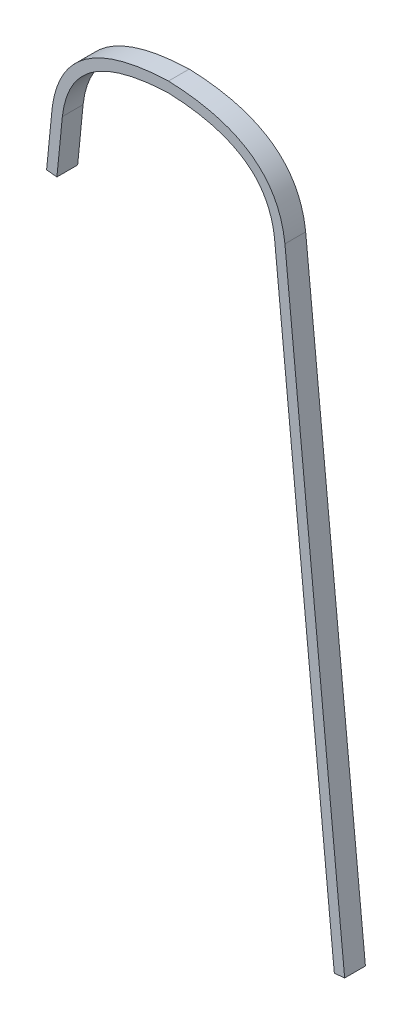
ISO-10303-21;
HEADER;
FILE_DESCRIPTION(('STEP AP214'),'2;1');
FILE_NAME('part.step','',(''),(''),'','','');
FILE_SCHEMA(('AUTOMOTIVE_DESIGN { 1 0 10303 214 1 1 1 1 }'));
ENDSEC;
DATA;
#1=APPLICATION_CONTEXT('core data for automotive mechanical design processes');
#2=APPLICATION_PROTOCOL_DEFINITION('international standard','automotive_design',2000,#1);
#3=PRODUCT_CONTEXT('',#1,'mechanical');
#4=PRODUCT('Part','Part','',(#3));
#5=PRODUCT_RELATED_PRODUCT_CATEGORY('part','',(#4));
#6=PRODUCT_DEFINITION_FORMATION('','',#4);
#7=PRODUCT_DEFINITION_CONTEXT('part definition',#1,'design');
#8=PRODUCT_DEFINITION('design','',#6,#7);
#9=PRODUCT_DEFINITION_SHAPE('','',#8);
#10=(LENGTH_UNIT() NAMED_UNIT(*) SI_UNIT(.MILLI.,.METRE.));
#11=(NAMED_UNIT(*) PLANE_ANGLE_UNIT() SI_UNIT($,.RADIAN.));
#12=(NAMED_UNIT(*) SI_UNIT($,.STERADIAN.) SOLID_ANGLE_UNIT());
#13=UNCERTAINTY_MEASURE_WITH_UNIT(LENGTH_MEASURE(1.E-05),#10,'distance_accuracy_value','');
#14=(GEOMETRIC_REPRESENTATION_CONTEXT(3) GLOBAL_UNCERTAINTY_ASSIGNED_CONTEXT((#13)) GLOBAL_UNIT_ASSIGNED_CONTEXT((#10,
#11,#12)) REPRESENTATION_CONTEXT('',''));
#15=CARTESIAN_POINT('',(0.,0.,0.));
#16=DIRECTION('',(0.,0.,1.));
#17=DIRECTION('',(1.,0.,0.));
#18=AXIS2_PLACEMENT_3D('',#15,#16,#17);
#19=CARTESIAN_POINT('',(106.876080835467,736.833680097404,19.05));
#20=CARTESIAN_POINT('',(98.6555645680486,809.385111394009,19.05));
#21=CARTESIAN_POINT('',(0.,812.8,19.05));
#22=B_SPLINE_CURVE_WITH_KNOTS('',2,(#19,#20,#21),.UNSPECIFIED.,.F.,.F.,(3,3),(0.,1.),.UNSPECIFIED.);
#23=DIRECTION('',(0.,0.,-1.));
#24=VECTOR('',#23,1.);
#25=SURFACE_OF_LINEAR_EXTRUSION('',#22,#24);
#26=CARTESIAN_POINT('',(106.876080835467,736.833680097404,0.));
#27=CARTESIAN_POINT('',(98.6555645680486,809.385111394009,0.));
#28=CARTESIAN_POINT('',(0.,812.8,0.));
#29=B_SPLINE_CURVE_WITH_KNOTS('',2,(#26,#27,#28),.UNSPECIFIED.,.F.,.F.,(3,3),(0.,1.),.UNSPECIFIED.);
#30=CARTESIAN_POINT('',(106.876080835467,736.833680097404,0.));
#31=VERTEX_POINT('',#30);
#32=CARTESIAN_POINT('',(0.,812.8,0.));
#33=VERTEX_POINT('',#32);
#34=EDGE_CURVE('E142',#31,#33,#29,.T.);
#35=ORIENTED_EDGE('',*,*,#34,.T.);
#36=DIRECTION('',(0.,0.,-1.));
#37=VECTOR('',#36,1.);
#38=CARTESIAN_POINT('',(0.,812.8,19.05));
#39=LINE('',#38,#37);
#40=CARTESIAN_POINT('',(0.,812.8,19.05));
#41=VERTEX_POINT('',#40);
#42=EDGE_CURVE('E11',#41,#33,#39,.T.);
#43=ORIENTED_EDGE('',*,*,#42,.F.);
#44=CARTESIAN_POINT('',(106.876080835467,736.833680097404,19.05));
#45=VERTEX_POINT('',#44);
#46=EDGE_CURVE('E180',#45,#41,#22,.T.);
#47=ORIENTED_EDGE('',*,*,#46,.F.);
#48=DIRECTION('',(0.,0.,-1.));
#49=VECTOR('',#48,1.);
#50=CARTESIAN_POINT('',(106.876080835467,736.833680097404,19.05));
#51=LINE('',#50,#49);
#52=EDGE_CURVE('E138',#45,#31,#51,.T.);
#53=ORIENTED_EDGE('',*,*,#52,.T.);
#54=EDGE_LOOP('',(#35,#43,#47,#53));
#55=FACE_BOUND('',#54,.T.);
#56=ADVANCED_FACE('F33',(#55),#25,.F.);
#57=CARTESIAN_POINT('',(0.,812.8,19.05));
#58=CARTESIAN_POINT('',(-98.6555645680486,809.385111394009,19.05));
#59=CARTESIAN_POINT('',(-106.876080835467,736.833680097404,19.05));
#60=B_SPLINE_CURVE_WITH_KNOTS('',2,(#57,#58,#59),.UNSPECIFIED.,.F.,.F.,(3,3),(0.,1.),.UNSPECIFIED.);
#61=DIRECTION('',(0.,0.,-1.));
#62=VECTOR('',#61,1.);
#63=SURFACE_OF_LINEAR_EXTRUSION('',#60,#62);
#64=CARTESIAN_POINT('',(0.,812.8,0.));
#65=CARTESIAN_POINT('',(-98.6555645680486,809.385111394009,0.));
#66=CARTESIAN_POINT('',(-106.876080835467,736.833680097404,0.));
#67=B_SPLINE_CURVE_WITH_KNOTS('',2,(#64,#65,#66),.UNSPECIFIED.,.F.,.F.,(3,3),(0.,1.),.UNSPECIFIED.);
#68=CARTESIAN_POINT('',(-106.876080835467,736.833680097404,0.));
#69=VERTEX_POINT('',#68);
#70=EDGE_CURVE('E147',#33,#69,#67,.T.);
#71=ORIENTED_EDGE('',*,*,#70,.T.);
#72=DIRECTION('',(0.,0.,-1.));
#73=VECTOR('',#72,1.);
#74=CARTESIAN_POINT('',(-106.876080835467,736.833680097404,19.05));
#75=LINE('',#74,#73);
#76=CARTESIAN_POINT('',(-106.876080835467,736.833680097404,19.05));
#77=VERTEX_POINT('',#76);
#78=EDGE_CURVE('E42',#77,#69,#75,.T.);
#79=ORIENTED_EDGE('',*,*,#78,.F.);
#80=EDGE_CURVE('E99',#41,#77,#60,.T.);
#81=ORIENTED_EDGE('',*,*,#80,.F.);
#82=ORIENTED_EDGE('',*,*,#42,.T.);
#83=EDGE_LOOP('',(#71,#79,#81,#82));
#84=FACE_BOUND('',#83,.T.);
#85=ADVANCED_FACE('F246',(#84),#63,.F.);
#86=CARTESIAN_POINT('',(-111.860365765845,686.278790089287,19.05));
#87=DIRECTION('',(0.995175000159784,-0.0981158450861761,0.));
#88=DIRECTION('',(0.0981158450861761,0.995175000159784,0.));
#89=AXIS2_PLACEMENT_3D('',#86,#87,#88);
#90=PLANE('',#89);
#91=DIRECTION('',(-0.0981158450861761,-0.995175000159784,0.));
#92=VECTOR('',#91,1.);
#93=CARTESIAN_POINT('',(-111.860365765845,686.278790089287,0.));
#94=LINE('',#93,#92);
#95=CARTESIAN_POINT('',(-111.860365765845,686.278790089287,0.));
#96=VERTEX_POINT('',#95);
#97=EDGE_CURVE('E154',#69,#96,#94,.T.);
#98=ORIENTED_EDGE('',*,*,#97,.T.);
#99=DIRECTION('',(0.,0.,-1.));
#100=VECTOR('',#99,1.);
#101=CARTESIAN_POINT('',(-111.860365765845,686.278790089287,19.05));
#102=LINE('',#101,#100);
#103=CARTESIAN_POINT('',(-111.860365765845,686.278790089287,19.05));
#104=VERTEX_POINT('',#103);
#105=EDGE_CURVE('E193',#104,#96,#102,.T.);
#106=ORIENTED_EDGE('',*,*,#105,.F.);
#107=DIRECTION('',(-0.0981158450861761,-0.995175000159784,0.));
#108=VECTOR('',#107,1.);
#109=CARTESIAN_POINT('',(-111.860365765845,686.278790089287,19.05));
#110=LINE('',#109,#108);
#111=EDGE_CURVE('E201',#77,#104,#110,.T.);
#112=ORIENTED_EDGE('',*,*,#111,.F.);
#113=ORIENTED_EDGE('',*,*,#78,.T.);
#114=EDGE_LOOP('',(#98,#106,#112,#113));
#115=FACE_BOUND('',#114,.T.);
#116=ADVANCED_FACE('F199',(#115),#90,.F.);
#117=CARTESIAN_POINT('',(-111.860365765845,686.278790089287,19.05));
#118=DIRECTION('',(0.0981158450861748,0.995175000159784,0.));
#119=DIRECTION('',(-0.995175000159784,0.0981158450861748,0.));
#120=AXIS2_PLACEMENT_3D('',#117,#118,#119);
#121=PLANE('',#120);
#122=DIRECTION('',(0.995175000159784,-0.0981158450861748,0.));
#123=VECTOR('',#122,1.);
#124=CARTESIAN_POINT('',(-111.860365765845,686.278790089287,0.));
#125=LINE('',#124,#123);
#126=CARTESIAN_POINT('',(-102.381323889323,685.344236664841,0.));
#127=VERTEX_POINT('',#126);
#128=EDGE_CURVE('E159',#96,#127,#125,.T.);
#129=ORIENTED_EDGE('',*,*,#128,.T.);
#130=DIRECTION('',(0.,0.,-1.));
#131=VECTOR('',#130,1.);
#132=CARTESIAN_POINT('',(-102.381323889323,685.344236664841,19.05));
#133=LINE('',#132,#131);
#134=CARTESIAN_POINT('',(-102.381323889323,685.344236664841,19.05));
#135=VERTEX_POINT('',#134);
#136=EDGE_CURVE('E190',#135,#127,#133,.T.);
#137=ORIENTED_EDGE('',*,*,#136,.F.);
#138=DIRECTION('',(0.995175000159784,-0.0981158450861748,0.));
#139=VECTOR('',#138,1.);
#140=CARTESIAN_POINT('',(-111.860365765845,686.278790089287,19.05));
#141=LINE('',#140,#139);
#142=EDGE_CURVE('E219',#104,#135,#141,.T.);
#143=ORIENTED_EDGE('',*,*,#142,.F.);
#144=ORIENTED_EDGE('',*,*,#105,.T.);
#145=EDGE_LOOP('',(#129,#137,#143,#144));
#146=FACE_BOUND('',#145,.T.);
#147=ADVANCED_FACE('F210',(#146),#121,.F.);
#148=CARTESIAN_POINT('',(-102.381323889323,685.344236664841,19.05));
#149=DIRECTION('',(-0.995175000159784,0.0981158450861753,0.));
#150=DIRECTION('',(-0.0981158450861753,-0.995175000159784,0.));
#151=AXIS2_PLACEMENT_3D('',#148,#149,#150);
#152=PLANE('',#151);
#153=DIRECTION('',(0.0981158450861753,0.995175000159784,0.));
#154=VECTOR('',#153,1.);
#155=CARTESIAN_POINT('',(-102.381323889323,685.344236664841,0.));
#156=LINE('',#155,#154);
#157=CARTESIAN_POINT('',(-97.4039935722563,735.828587023661,0.));
#158=VERTEX_POINT('',#157);
#159=EDGE_CURVE('E161',#127,#158,#156,.T.);
#160=ORIENTED_EDGE('',*,*,#159,.T.);
#161=DIRECTION('',(0.,0.,-1.));
#162=VECTOR('',#161,1.);
#163=CARTESIAN_POINT('',(-97.4039935722563,735.828587023661,19.05));
#164=LINE('',#163,#162);
#165=CARTESIAN_POINT('',(-97.4039935722563,735.828587023661,19.05));
#166=VERTEX_POINT('',#165);
#167=EDGE_CURVE('E187',#166,#158,#164,.T.);
#168=ORIENTED_EDGE('',*,*,#167,.F.);
#169=DIRECTION('',(0.0981158450861753,0.995175000159784,0.));
#170=VECTOR('',#169,1.);
#171=CARTESIAN_POINT('',(-102.381323889323,685.344236664841,19.05));
#172=LINE('',#171,#170);
#173=EDGE_CURVE('E216',#135,#166,#172,.T.);
#174=ORIENTED_EDGE('',*,*,#173,.F.);
#175=ORIENTED_EDGE('',*,*,#136,.T.);
#176=EDGE_LOOP('',(#160,#168,#174,#175));
#177=FACE_BOUND('',#176,.T.);
#178=ADVANCED_FACE('F214',(#177),#152,.F.);
#179=CARTESIAN_POINT('',(-97.4039935722563,735.828587023661,19.05));
#180=CARTESIAN_POINT('',(-97.326205951253,736.510966359989,19.05));
#181=CARTESIAN_POINT('',(-97.155379667203,737.881968464563,19.05));
#182=CARTESIAN_POINT('',(-96.7640206157551,740.553537606214,19.05));
#183=CARTESIAN_POINT('',(-96.1773627381843,743.805316844232,19.05));
#184=CARTESIAN_POINT('',(-95.3214140006335,747.554999290884,19.05));
#185=CARTESIAN_POINT('',(-93.979934001174,752.35928640652,19.05));
#186=CARTESIAN_POINT('',(-91.9331304846639,758.003164249531,19.05));
#187=CARTESIAN_POINT('',(-88.8952522600488,764.228265264045,19.05));
#188=CARTESIAN_POINT('',(-85.2743135617032,769.94319981308,19.05));
#189=CARTESIAN_POINT('',(-79.6482414168445,776.932392043285,19.05));
#190=CARTESIAN_POINT('',(-71.0507907120023,784.572420077555,19.05));
#191=CARTESIAN_POINT('',(-60.1294569627952,790.832450745801,19.05));
#192=CARTESIAN_POINT('',(-49.8978420395021,794.967332344282,19.05));
#193=CARTESIAN_POINT('',(-41.4669949701455,797.61410959326,19.05));
#194=CARTESIAN_POINT('',(-32.2731280075788,799.790052384111,19.05));
#195=CARTESIAN_POINT('',(-23.9757920629625,801.198424890801,19.05));
#196=CARTESIAN_POINT('',(-16.9573043317651,802.075979485788,19.05));
#197=CARTESIAN_POINT('',(-11.5049121120337,802.608232021653,19.05));
#198=CARTESIAN_POINT('',(-6.80036284859541,802.946009067599,19.05));
#199=CARTESIAN_POINT('',(-2.95007512349241,803.15190905775,19.05));
#200=CARTESIAN_POINT('',(-0.979817657945961,803.233925105122,19.05));
#201=CARTESIAN_POINT('',(4.83499958819911E-13,803.269086279872,19.05));
#202=B_SPLINE_CURVE_WITH_KNOTS('',3,(#179,#180,#181,#182,#183,#184,#185,#186,#187,#188,#189,
#190,#191,#192,#193,#194,#195,#196,#197,#198,#199,#200,#201),.UNSPECIFIED.,.F.,.F.,(4,1,1,1,1,1,
1,1,1,1,1,1,1,1,1,1,1,1,1,1,4),(0.000508173003004952,0.0160981610015977,0.0316881490001905,
0.062868124997376,0.0940481009945616,0.125228076991747,0.187588028986118,0.249947980980489,
0.31230793297486,0.374667884969231,0.499387788957974,0.624107692946716,0.686467644941087,
0.748827596935458,0.811187548929829,0.8735475009242,0.904727476921386,0.935907452918571,
0.967087428915757,0.98267741691435,0.998267404912942),.UNSPECIFIED.);
#203=DIRECTION('',(0.,0.,-1.));
#204=VECTOR('',#203,1.);
#205=SURFACE_OF_LINEAR_EXTRUSION('',#202,#204);
#206=CARTESIAN_POINT('',(-97.4039935722563,735.828587023661,0.));
#207=CARTESIAN_POINT('',(-97.326205951253,736.510966359989,0.));
#208=CARTESIAN_POINT('',(-97.155379667203,737.881968464563,0.));
#209=CARTESIAN_POINT('',(-96.7640206157551,740.553537606214,0.));
#210=CARTESIAN_POINT('',(-96.1773627381843,743.805316844232,0.));
#211=CARTESIAN_POINT('',(-95.3214140006335,747.554999290884,0.));
#212=CARTESIAN_POINT('',(-93.979934001174,752.35928640652,0.));
#213=CARTESIAN_POINT('',(-91.9331304846639,758.003164249531,0.));
#214=CARTESIAN_POINT('',(-88.8952522600488,764.228265264045,0.));
#215=CARTESIAN_POINT('',(-85.2743135617032,769.94319981308,0.));
#216=CARTESIAN_POINT('',(-79.6482414168445,776.932392043285,0.));
#217=CARTESIAN_POINT('',(-71.0507907120023,784.572420077555,0.));
#218=CARTESIAN_POINT('',(-60.1294569627952,790.832450745801,0.));
#219=CARTESIAN_POINT('',(-49.8978420395021,794.967332344282,0.));
#220=CARTESIAN_POINT('',(-41.4669949701455,797.61410959326,0.));
#221=CARTESIAN_POINT('',(-32.2731280075788,799.790052384111,0.));
#222=CARTESIAN_POINT('',(-23.9757920629625,801.198424890801,0.));
#223=CARTESIAN_POINT('',(-16.9573043317651,802.075979485788,0.));
#224=CARTESIAN_POINT('',(-11.5049121120337,802.608232021653,0.));
#225=CARTESIAN_POINT('',(-6.80036284859541,802.946009067599,0.));
#226=CARTESIAN_POINT('',(-2.95007512349241,803.15190905775,0.));
#227=CARTESIAN_POINT('',(-0.979817657945961,803.233925105122,0.));
#228=CARTESIAN_POINT('',(4.83499958819911E-13,803.269086279872,0.));
#229=B_SPLINE_CURVE_WITH_KNOTS('',3,(#206,#207,#208,#209,#210,#211,#212,#213,#214,#215,#216,
#217,#218,#219,#220,#221,#222,#223,#224,#225,#226,#227,#228),.UNSPECIFIED.,.F.,.F.,(4,1,1,1,1,1,
1,1,1,1,1,1,1,1,1,1,1,1,1,1,4),(0.000508173003004952,0.0160981610015977,0.0316881490001905,
0.062868124997376,0.0940481009945616,0.125228076991747,0.187588028986118,0.249947980980489,
0.31230793297486,0.374667884969231,0.499387788957974,0.624107692946716,0.686467644941087,
0.748827596935458,0.811187548929829,0.8735475009242,0.904727476921386,0.935907452918571,
0.967087428915757,0.98267741691435,0.998267404912942),.UNSPECIFIED.);
#230=CARTESIAN_POINT('',(4.83499958819911E-13,803.269086279872,0.));
#231=VERTEX_POINT('',#230);
#232=EDGE_CURVE('E163',#158,#231,#229,.T.);
#233=ORIENTED_EDGE('',*,*,#232,.T.);
#234=DIRECTION('',(0.,0.,-1.));
#235=VECTOR('',#234,1.);
#236=CARTESIAN_POINT('',(4.83499958819911E-13,803.269086279872,19.05));
#237=LINE('',#236,#235);
#238=CARTESIAN_POINT('',(4.83499958819911E-13,803.269086279872,19.05));
#239=VERTEX_POINT('',#238);
#240=EDGE_CURVE('E184',#239,#231,#237,.T.);
#241=ORIENTED_EDGE('',*,*,#240,.F.);
#242=EDGE_CURVE('E218',#166,#239,#202,.T.);
#243=ORIENTED_EDGE('',*,*,#242,.F.);
#244=ORIENTED_EDGE('',*,*,#167,.T.);
#245=EDGE_LOOP('',(#233,#241,#243,#244));
#246=FACE_BOUND('',#245,.T.);
#247=ADVANCED_FACE('F234',(#246),#205,.F.);
#248=CARTESIAN_POINT('',(-4.7309161796405E-13,803.269086279872,19.05));
#249=CARTESIAN_POINT('',(0.979817657945972,803.233925105122,19.05));
#250=CARTESIAN_POINT('',(2.95007512349243,803.15190905775,19.05));
#251=CARTESIAN_POINT('',(6.80036284859539,802.946009067599,19.05));
#252=CARTESIAN_POINT('',(11.5049121120337,802.608232021652,19.05));
#253=CARTESIAN_POINT('',(16.957304331765,802.075979485789,19.05));
#254=CARTESIAN_POINT('',(23.9757920629625,801.1984248908,19.05));
#255=CARTESIAN_POINT('',(32.2731280075787,799.79005238411,19.05));
#256=CARTESIAN_POINT('',(41.4669949701454,797.61410959326,19.05));
#257=CARTESIAN_POINT('',(49.897842039502,794.967332344282,19.05));
#258=CARTESIAN_POINT('',(60.129456962795,790.832450745801,19.05));
#259=CARTESIAN_POINT('',(71.0507907120021,784.572420077556,19.05));
#260=CARTESIAN_POINT('',(79.6482414168444,776.932392043285,19.05));
#261=CARTESIAN_POINT('',(85.2743135617031,769.94319981308,19.05));
#262=CARTESIAN_POINT('',(88.8952522600487,764.228265264045,19.05));
#263=CARTESIAN_POINT('',(91.9331304846638,758.003164249531,19.05));
#264=CARTESIAN_POINT('',(93.979934001174,752.359286406521,19.05));
#265=CARTESIAN_POINT('',(95.3214140006334,747.554999290885,19.05));
#266=CARTESIAN_POINT('',(96.1773627381843,743.805316844233,19.05));
#267=CARTESIAN_POINT('',(96.764020615755,740.553537606215,19.05));
#268=CARTESIAN_POINT('',(97.155379667203,737.881968464564,19.05));
#269=CARTESIAN_POINT('',(97.326205951253,736.51096635999,19.05));
#270=CARTESIAN_POINT('',(97.4039935722562,735.828587023662,19.05));
#271=B_SPLINE_CURVE_WITH_KNOTS('',3,(#248,#249,#250,#251,#252,#253,#254,#255,#256,#257,#258,
#259,#260,#261,#262,#263,#264,#265,#266,#267,#268,#269,#270),.UNSPECIFIED.,.F.,.F.,(4,1,1,1,1,1,
1,1,1,1,1,1,1,1,1,1,1,1,1,1,4),(0.000508173003007761,0.0160981610016004,0.0316881490001932,
0.0628681249973786,0.0940481009945641,0.12522807699175,0.18758802898612,0.249947980980491,
0.312307932974862,0.374667884969233,0.499387788957975,0.624107692946717,0.686467644941088,
0.748827596935459,0.811187548929829,0.8735475009242,0.904727476921386,0.935907452918571,
0.967087428915757,0.982677416914349,0.998267404912942),.UNSPECIFIED.);
#272=DIRECTION('',(0.,0.,-1.));
#273=VECTOR('',#272,1.);
#274=SURFACE_OF_LINEAR_EXTRUSION('',#271,#273);
#275=CARTESIAN_POINT('',(-4.7309161796405E-13,803.269086279872,0.));
#276=CARTESIAN_POINT('',(0.979817657945972,803.233925105122,0.));
#277=CARTESIAN_POINT('',(2.95007512349243,803.15190905775,0.));
#278=CARTESIAN_POINT('',(6.80036284859539,802.946009067599,0.));
#279=CARTESIAN_POINT('',(11.5049121120337,802.608232021652,0.));
#280=CARTESIAN_POINT('',(16.957304331765,802.075979485789,0.));
#281=CARTESIAN_POINT('',(23.9757920629625,801.1984248908,0.));
#282=CARTESIAN_POINT('',(32.2731280075787,799.79005238411,0.));
#283=CARTESIAN_POINT('',(41.4669949701454,797.61410959326,0.));
#284=CARTESIAN_POINT('',(49.897842039502,794.967332344282,0.));
#285=CARTESIAN_POINT('',(60.129456962795,790.832450745801,0.));
#286=CARTESIAN_POINT('',(71.0507907120021,784.572420077556,0.));
#287=CARTESIAN_POINT('',(79.6482414168444,776.932392043285,0.));
#288=CARTESIAN_POINT('',(85.2743135617031,769.94319981308,0.));
#289=CARTESIAN_POINT('',(88.8952522600487,764.228265264045,0.));
#290=CARTESIAN_POINT('',(91.9331304846638,758.003164249531,0.));
#291=CARTESIAN_POINT('',(93.979934001174,752.359286406521,0.));
#292=CARTESIAN_POINT('',(95.3214140006334,747.554999290885,0.));
#293=CARTESIAN_POINT('',(96.1773627381843,743.805316844233,0.));
#294=CARTESIAN_POINT('',(96.764020615755,740.553537606215,0.));
#295=CARTESIAN_POINT('',(97.155379667203,737.881968464564,0.));
#296=CARTESIAN_POINT('',(97.326205951253,736.51096635999,0.));
#297=CARTESIAN_POINT('',(97.4039935722562,735.828587023662,0.));
#298=B_SPLINE_CURVE_WITH_KNOTS('',3,(#275,#276,#277,#278,#279,#280,#281,#282,#283,#284,#285,
#286,#287,#288,#289,#290,#291,#292,#293,#294,#295,#296,#297),.UNSPECIFIED.,.F.,.F.,(4,1,1,1,1,1,
1,1,1,1,1,1,1,1,1,1,1,1,1,1,4),(0.000508173003007761,0.0160981610016004,0.0316881490001932,
0.0628681249973786,0.0940481009945641,0.12522807699175,0.18758802898612,0.249947980980491,
0.312307932974862,0.374667884969233,0.499387788957975,0.624107692946717,0.686467644941088,
0.748827596935459,0.811187548929829,0.8735475009242,0.904727476921386,0.935907452918571,
0.967087428915757,0.982677416914349,0.998267404912942),.UNSPECIFIED.);
#299=CARTESIAN_POINT('',(97.4039935722562,735.828587023662,0.));
#300=VERTEX_POINT('',#299);
#301=EDGE_CURVE('E167',#231,#300,#298,.T.);
#302=ORIENTED_EDGE('',*,*,#301,.T.);
#303=DIRECTION('',(0.,0.,-1.));
#304=VECTOR('',#303,1.);
#305=CARTESIAN_POINT('',(97.4039935722562,735.828587023662,19.05));
#306=LINE('',#305,#304);
#307=CARTESIAN_POINT('',(97.4039935722562,735.828587023662,19.05));
#308=VERTEX_POINT('',#307);
#309=EDGE_CURVE('E133',#308,#300,#306,.T.);
#310=ORIENTED_EDGE('',*,*,#309,.F.);
#311=EDGE_CURVE('E124',#239,#308,#271,.T.);
#312=ORIENTED_EDGE('',*,*,#311,.F.);
#313=ORIENTED_EDGE('',*,*,#240,.T.);
#314=EDGE_LOOP('',(#302,#310,#312,#313));
#315=FACE_BOUND('',#314,.T.);
#316=ADVANCED_FACE('F238',(#315),#274,.F.);
#317=CARTESIAN_POINT('',(152.2241731931,179.795336583671,19.05));
#318=DIRECTION('',(0.995175000159784,0.0981158450861758,0.));
#319=DIRECTION('',(-0.0981158450861758,0.995175000159784,0.));
#320=AXIS2_PLACEMENT_3D('',#317,#318,#319);
#321=PLANE('',#320);
#322=DIRECTION('',(0.0981158450861758,-0.995175000159784,0.));
#323=VECTOR('',#322,1.);
#324=CARTESIAN_POINT('',(152.2241731931,179.795336583671,0.));
#325=LINE('',#324,#323);
#326=CARTESIAN_POINT('',(152.2241731931,179.795336583671,0.));
#327=VERTEX_POINT('',#326);
#328=EDGE_CURVE('E132',#300,#327,#325,.T.);
#329=ORIENTED_EDGE('',*,*,#328,.T.);
#330=DIRECTION('',(0.,0.,-1.));
#331=VECTOR('',#330,1.);
#332=CARTESIAN_POINT('',(152.2241731931,179.795336583671,19.05));
#333=LINE('',#332,#331);
#334=CARTESIAN_POINT('',(152.2241731931,179.795336583671,19.05));
#335=VERTEX_POINT('',#334);
#336=EDGE_CURVE('E129',#335,#327,#333,.T.);
#337=ORIENTED_EDGE('',*,*,#336,.F.);
#338=DIRECTION('',(0.0981158450861758,-0.995175000159784,0.));
#339=VECTOR('',#338,1.);
#340=CARTESIAN_POINT('',(152.2241731931,179.795336583671,19.05));
#341=LINE('',#340,#339);
#342=EDGE_CURVE('E118',#308,#335,#341,.T.);
#343=ORIENTED_EDGE('',*,*,#342,.F.);
#344=ORIENTED_EDGE('',*,*,#309,.T.);
#345=EDGE_LOOP('',(#329,#337,#343,#344));
#346=FACE_BOUND('',#345,.T.);
#347=ADVANCED_FACE('F130',(#346),#321,.F.);
#348=CARTESIAN_POINT('',(152.2241731931,179.795336583671,19.05));
#349=DIRECTION('',(-0.098115845086175,0.995175000159784,0.));
#350=DIRECTION('',(-0.995175000159784,-0.0981158450861751,0.));
#351=AXIS2_PLACEMENT_3D('',#348,#349,#350);
#352=PLANE('',#351);
#353=DIRECTION('',(0.995175000159784,0.098115845086175,0.));
#354=VECTOR('',#353,1.);
#355=CARTESIAN_POINT('',(152.2241731931,179.795336583671,0.));
#356=LINE('',#355,#354);
#357=CARTESIAN_POINT('',(161.703215069622,180.729890008117,0.));
#358=VERTEX_POINT('',#357);
#359=EDGE_CURVE('E85',#327,#358,#356,.T.);
#360=ORIENTED_EDGE('',*,*,#359,.T.);
#361=DIRECTION('',(0.,0.,-1.));
#362=VECTOR('',#361,1.);
#363=CARTESIAN_POINT('',(161.703215069622,180.729890008117,19.05));
#364=LINE('',#363,#362);
#365=CARTESIAN_POINT('',(161.703215069622,180.729890008117,19.05));
#366=VERTEX_POINT('',#365);
#367=EDGE_CURVE('E134',#366,#358,#364,.T.);
#368=ORIENTED_EDGE('',*,*,#367,.F.);
#369=DIRECTION('',(0.995175000159784,0.098115845086175,0.));
#370=VECTOR('',#369,1.);
#371=CARTESIAN_POINT('',(152.2241731931,179.795336583671,19.05));
#372=LINE('',#371,#370);
#373=EDGE_CURVE('E122',#335,#366,#372,.T.);
#374=ORIENTED_EDGE('',*,*,#373,.F.);
#375=ORIENTED_EDGE('',*,*,#336,.T.);
#376=EDGE_LOOP('',(#360,#368,#374,#375));
#377=FACE_BOUND('',#376,.T.);
#378=ADVANCED_FACE('F136',(#377),#352,.F.);
#379=CARTESIAN_POINT('',(161.703215069622,180.729890008117,19.05));
#380=DIRECTION('',(-0.995175000159784,-0.0981158450861758,0.));
#381=DIRECTION('',(0.0981158450861758,-0.995175000159784,0.));
#382=AXIS2_PLACEMENT_3D('',#379,#380,#381);
#383=PLANE('',#382);
#384=DIRECTION('',(-0.0981158450861758,0.995175000159784,0.));
#385=VECTOR('',#384,1.);
#386=CARTESIAN_POINT('',(161.703215069622,180.729890008117,0.));
#387=LINE('',#386,#385);
#388=EDGE_CURVE('E91',#358,#31,#387,.T.);
#389=ORIENTED_EDGE('',*,*,#388,.T.);
#390=ORIENTED_EDGE('',*,*,#52,.F.);
#391=DIRECTION('',(-0.0981158450861758,0.995175000159784,0.));
#392=VECTOR('',#391,1.);
#393=CARTESIAN_POINT('',(161.703215069622,180.729890008117,19.05));
#394=LINE('',#393,#392);
#395=EDGE_CURVE('E50',#366,#45,#394,.T.);
#396=ORIENTED_EDGE('',*,*,#395,.F.);
#397=ORIENTED_EDGE('',*,*,#367,.T.);
#398=EDGE_LOOP('',(#389,#390,#396,#397));
#399=FACE_BOUND('',#398,.T.);
#400=ADVANCED_FACE('F310',(#399),#383,.F.);
#401=CARTESIAN_POINT('',(76.0468024928911,792.100975721355,19.05));
#402=DIRECTION('',(0.,0.,-1.));
#403=DIRECTION('',(-1.,0.,0.));
#404=AXIS2_PLACEMENT_3D('',#401,#402,#403);
#405=PLANE('',#404);
#406=ORIENTED_EDGE('',*,*,#46,.T.);
#407=ORIENTED_EDGE('',*,*,#80,.T.);
#408=ORIENTED_EDGE('',*,*,#111,.T.);
#409=ORIENTED_EDGE('',*,*,#142,.T.);
#410=ORIENTED_EDGE('',*,*,#173,.T.);
#411=ORIENTED_EDGE('',*,*,#242,.T.);
#412=ORIENTED_EDGE('',*,*,#311,.T.);
#413=ORIENTED_EDGE('',*,*,#342,.T.);
#414=ORIENTED_EDGE('',*,*,#373,.T.);
#415=ORIENTED_EDGE('',*,*,#395,.T.);
#416=EDGE_LOOP('',(#406,#407,#408,#409,#410,#411,#412,#413,#414,#415));
#417=FACE_BOUND('',#416,.T.);
#418=ADVANCED_FACE('F120',(#417),#405,.F.);
#419=CARTESIAN_POINT('',(76.0468024928911,792.100975721355,0.));
#420=DIRECTION('',(0.,0.,-1.));
#421=DIRECTION('',(-1.,0.,0.));
#422=AXIS2_PLACEMENT_3D('',#419,#420,#421);
#423=PLANE('',#422);
#424=ORIENTED_EDGE('',*,*,#34,.F.);
#425=ORIENTED_EDGE('',*,*,#388,.F.);
#426=ORIENTED_EDGE('',*,*,#359,.F.);
#427=ORIENTED_EDGE('',*,*,#328,.F.);
#428=ORIENTED_EDGE('',*,*,#301,.F.);
#429=ORIENTED_EDGE('',*,*,#232,.F.);
#430=ORIENTED_EDGE('',*,*,#159,.F.);
#431=ORIENTED_EDGE('',*,*,#128,.F.);
#432=ORIENTED_EDGE('',*,*,#97,.F.);
#433=ORIENTED_EDGE('',*,*,#70,.F.);
#434=EDGE_LOOP('',(#424,#425,#426,#427,#428,#429,#430,#431,#432,#433));
#435=FACE_BOUND('',#434,.T.);
#436=ADVANCED_FACE('F205',(#435),#423,.T.);
#437=CLOSED_SHELL('',(#56,#85,#116,#147,#178,#247,#316,#347,#378,#400,#418,#436));
#438=MANIFOLD_SOLID_BREP('B2',#437);
#439=ADVANCED_BREP_SHAPE_REPRESENTATION('',(#18,#438),#14);
#440=SHAPE_DEFINITION_REPRESENTATION(#9,#439);
ENDSEC;
END-ISO-10303-21;
